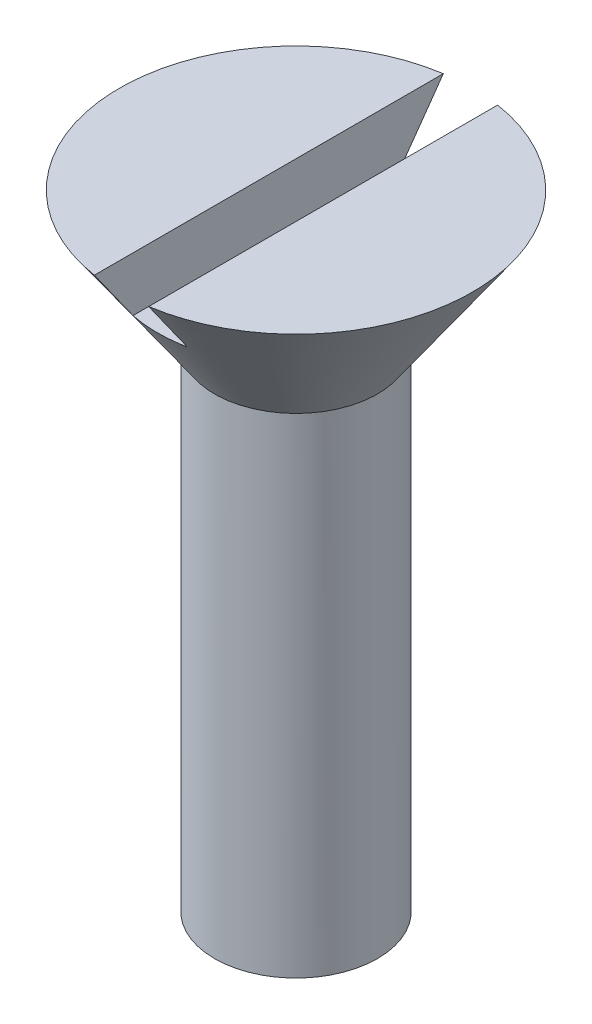
ISO-10303-21;
HEADER;
FILE_DESCRIPTION(('STEP AP214'),'2;1');
FILE_NAME('part.step','',(''),(''),'','','');
FILE_SCHEMA(('AUTOMOTIVE_DESIGN { 1 0 10303 214 1 1 1 1 }'));
ENDSEC;
DATA;
#1=APPLICATION_CONTEXT('core data for automotive mechanical design processes');
#2=APPLICATION_PROTOCOL_DEFINITION('international standard','automotive_design',2000,#1);
#3=PRODUCT_CONTEXT('',#1,'mechanical');
#4=PRODUCT('Part','Part','',(#3));
#5=PRODUCT_RELATED_PRODUCT_CATEGORY('part','',(#4));
#6=PRODUCT_DEFINITION_FORMATION('','',#4);
#7=PRODUCT_DEFINITION_CONTEXT('part definition',#1,'design');
#8=PRODUCT_DEFINITION('design','',#6,#7);
#9=PRODUCT_DEFINITION_SHAPE('','',#8);
#10=(LENGTH_UNIT() NAMED_UNIT(*) SI_UNIT(.MILLI.,.METRE.));
#11=(NAMED_UNIT(*) PLANE_ANGLE_UNIT() SI_UNIT($,.RADIAN.));
#12=(NAMED_UNIT(*) SI_UNIT($,.STERADIAN.) SOLID_ANGLE_UNIT());
#13=UNCERTAINTY_MEASURE_WITH_UNIT(LENGTH_MEASURE(1.E-05),#10,'distance_accuracy_value','');
#14=(GEOMETRIC_REPRESENTATION_CONTEXT(3) GLOBAL_UNCERTAINTY_ASSIGNED_CONTEXT((#13)) GLOBAL_UNIT_ASSIGNED_CONTEXT((#10,
#11,#12)) REPRESENTATION_CONTEXT('',''));
#15=CARTESIAN_POINT('',(0.,0.,0.));
#16=DIRECTION('',(0.,0.,1.));
#17=DIRECTION('',(1.,0.,0.));
#18=AXIS2_PLACEMENT_3D('',#15,#16,#17);
#19=CARTESIAN_POINT('',(6.5,24.7320508075689,0.));
#20=DIRECTION('',(0.,1.,0.));
#21=DIRECTION('',(0.,0.,1.));
#22=AXIS2_PLACEMENT_3D('',#19,#20,#21);
#23=PLANE('',#22);
#24=DIRECTION('',(0.,0.,1.));
#25=VECTOR('',#24,1.);
#26=CARTESIAN_POINT('',(-1.,24.7320508075689,0.));
#27=LINE('',#26,#25);
#28=CARTESIAN_POINT('',(-1.,24.7320508075689,-6.42261628933256));
#29=VERTEX_POINT('',#28);
#30=CARTESIAN_POINT('',(-1.,24.7320508075689,6.42261628933256));
#31=VERTEX_POINT('',#30);
#32=EDGE_CURVE('E100',#29,#31,#27,.T.);
#33=ORIENTED_EDGE('',*,*,#32,.F.);
#34=CARTESIAN_POINT('',(0.,24.7320508075689,0.));
#35=DIRECTION('',(0.,-1.,0.));
#36=DIRECTION('',(0.,0.,-1.));
#37=AXIS2_PLACEMENT_3D('',#34,#35,#36);
#38=CIRCLE('',#37,6.5);
#39=EDGE_CURVE('E112',#31,#29,#38,.T.);
#40=ORIENTED_EDGE('',*,*,#39,.F.);
#41=EDGE_LOOP('',(#33,#40));
#42=FACE_BOUND('',#41,.T.);
#43=ADVANCED_FACE('F38',(#42),#23,.T.);
#44=CARTESIAN_POINT('',(0.,0.,0.));
#45=DIRECTION('',(0.,1.,0.));
#46=DIRECTION('',(0.,0.,1.));
#47=AXIS2_PLACEMENT_3D('',#44,#45,#46);
#48=CONICAL_SURFACE('',#47,0.,1.0471975511966);
#49=CARTESIAN_POINT('',(0.,1.73205080756887,0.));
#50=DIRECTION('',(0.,-1.,0.));
#51=DIRECTION('',(0.,0.,-1.));
#52=AXIS2_PLACEMENT_3D('',#49,#50,#51);
#53=CIRCLE('',#52,3.);
#54=CARTESIAN_POINT('',(0.,1.73205080756887,-3.));
#55=VERTEX_POINT('',#54);
#56=EDGE_CURVE('E103',#55,#55,#53,.T.);
#57=ORIENTED_EDGE('',*,*,#56,.T.);
#58=EDGE_LOOP('',(#57));
#59=FACE_BOUND('',#58,.T.);
#60=CARTESIAN_POINT('',(0.,0.,0.));
#61=VERTEX_POINT('',#60);
#62=VERTEX_LOOP('',#61);
#63=FACE_BOUND('',#62,.T.);
#64=ADVANCED_FACE('F40',(#59,#63),#48,.T.);
#65=CARTESIAN_POINT('',(0.,-8.0008177119333,0.));
#66=DIRECTION('',(0.,-1.,0.));
#67=DIRECTION('',(0.,0.,-1.));
#68=AXIS2_PLACEMENT_3D('',#65,#66,#67);
#69=CYLINDRICAL_SURFACE('',#68,3.);
#70=CARTESIAN_POINT('',(0.,19.7320508075689,0.));
#71=DIRECTION('',(0.,-1.,0.));
#72=DIRECTION('',(0.,0.,-1.));
#73=AXIS2_PLACEMENT_3D('',#70,#71,#72);
#74=CIRCLE('',#73,3.);
#75=CARTESIAN_POINT('',(0.,19.7320508075689,-3.));
#76=VERTEX_POINT('',#75);
#77=EDGE_CURVE('E108',#76,#76,#74,.T.);
#78=ORIENTED_EDGE('',*,*,#77,.T.);
#79=EDGE_LOOP('',(#78));
#80=FACE_BOUND('',#79,.T.);
#81=ORIENTED_EDGE('',*,*,#56,.F.);
#82=EDGE_LOOP('',(#81));
#83=FACE_BOUND('',#82,.T.);
#84=ADVANCED_FACE('F139',(#80,#83),#69,.T.);
#85=CARTESIAN_POINT('',(0.,19.7320508075689,0.));
#86=DIRECTION('',(0.,1.,0.));
#87=DIRECTION('',(0.,0.,1.));
#88=AXIS2_PLACEMENT_3D('',#85,#86,#87);
#89=CONICAL_SURFACE('',#88,3.,0.610725964389209);
#90=CARTESIAN_POINT('',(-1.,24.7327508075689,6.4231121927069));
#91=CARTESIAN_POINT('',(-1.,24.4816478343582,6.24521507547194));
#92=CARTESIAN_POINT('',(-1.,24.230620458814,6.06721105785794));
#93=CARTESIAN_POINT('',(-1.,23.7287653728335,5.71088793330972));
#94=CARTESIAN_POINT('',(-1.,23.477937676158,5.53256880699694));
#95=CARTESIAN_POINT('',(-1.,22.9758036344212,5.17499647886703));
#96=CARTESIAN_POINT('',(-1.,22.7244981387982,4.99574208349889));
#97=CARTESIAN_POINT('',(-1.,22.2222921616879,4.63669913452876));
#98=CARTESIAN_POINT('',(-0.999999999999999,21.9713916564717,4.45691061411517));
#99=CARTESIAN_POINT('',(-0.999999999999999,21.4113851281488,4.05434246098988));
#100=CARTESIAN_POINT('',(-0.999999999999999,21.1024215497345,3.83136424535592));
#101=CARTESIAN_POINT('',(-0.999999999999999,20.6399833306106,3.49544297230533));
#102=CARTESIAN_POINT('',(-0.999999999999999,20.4859892965073,3.38321524822287));
#103=CARTESIAN_POINT('',(-0.999999999999999,20.1784731953449,3.15811915839284));
#104=CARTESIAN_POINT('',(-0.999999999999999,20.0249511215442,3.04525080186237));
#105=CARTESIAN_POINT('',(-0.999999999999999,19.718949442271,2.81893473483323));
#106=CARTESIAN_POINT('',(-0.999999999999999,19.5664681653534,2.70548928810727));
#107=CARTESIAN_POINT('',(-0.999999999999999,19.2624202540632,2.47735955209802));
#108=CARTESIAN_POINT('',(-0.999999999999999,19.1108536738174,2.36267519060135));
#109=CARTESIAN_POINT('',(-0.999999999999999,18.809159033189,2.13153400820381));
#110=CARTESIAN_POINT('',(-0.999999999999999,18.6590304598624,2.01507786083154));
#111=CARTESIAN_POINT('',(-0.999999999999999,18.4355564824097,1.83823431248961));
#112=CARTESIAN_POINT('',(-0.999999999999999,18.3613552017325,1.77892951008025));
#113=CARTESIAN_POINT('',(-0.999999999999999,18.2137184400952,1.65937552484643));
#114=CARTESIAN_POINT('',(-0.999999999999999,18.1402829356587,1.59912637111531));
#115=CARTESIAN_POINT('',(-0.999999999999999,18.0183910739441,1.49735496061013));
#116=CARTESIAN_POINT('',(-0.999999999999999,17.9696474909647,1.45617701216027));
#117=CARTESIAN_POINT('',(-0.999999999999999,17.8727548774056,1.37311830533831));
#118=CARTESIAN_POINT('',(-0.999999999999999,17.8246058929168,1.33123749306917));
#119=CARTESIAN_POINT('',(-0.999999999999999,17.7289030340928,1.24644783826052));
#120=CARTESIAN_POINT('',(-0.999999999999999,17.6813519992002,1.20353578171963));
#121=CARTESIAN_POINT('',(-0.999999999999999,17.5872849160699,1.11660199553977));
#122=CARTESIAN_POINT('',(-0.999999999999999,17.5407687000913,1.07258044824988));
#123=CARTESIAN_POINT('',(-0.999999999999999,17.4503329622812,0.984258875571616));
#124=CARTESIAN_POINT('',(-0.999999999999999,17.4063773625437,0.939995978319388));
#125=CARTESIAN_POINT('',(-0.999999999999999,17.3203433250885,0.849685965186151));
#126=CARTESIAN_POINT('',(-0.999999999999999,17.2782643855641,0.803639332492838));
#127=CARTESIAN_POINT('',(-0.999999999999999,17.1970522277732,0.709408627074623));
#128=CARTESIAN_POINT('',(-0.999999999999999,17.157905031252,0.66123670433491));
#129=CARTESIAN_POINT('',(-0.999999999999999,17.0837947987634,0.561804744039555));
#130=CARTESIAN_POINT('',(-0.999999999999999,17.0488242705169,0.510550491890749));
#131=CARTESIAN_POINT('',(-0.999999999999999,17.0044323851084,0.435811432213111));
#132=CARTESIAN_POINT('',(-0.999999999999999,16.9922117729092,0.413994672182494));
#133=CARTESIAN_POINT('',(-0.999999999999999,16.96910325899,0.369660988832996));
#134=CARTESIAN_POINT('',(-0.999999999999999,16.9582158295957,0.347143820893278));
#135=CARTESIAN_POINT('',(-0.999999999999999,16.9280475173432,0.278664441259216));
#136=CARTESIAN_POINT('',(-0.999999999999999,16.911142164786,0.231583649581735));
#137=CARTESIAN_POINT('',(-0.999999999999999,16.8885249993827,0.143751659910728));
#138=CARTESIAN_POINT('',(-0.999999999999999,16.8813458036271,0.103387133416546));
#139=CARTESIAN_POINT('',(-0.999999999999999,16.8740759410857,0.0219594036923862));
#140=CARTESIAN_POINT('',(-0.999999999999999,16.87399032981,-0.0191042769698395));
#141=CARTESIAN_POINT('',(-0.999999999999999,16.8809302935727,-0.100503321516519));
#142=CARTESIAN_POINT('',(-0.999999999999999,16.8879401011999,-0.140840098426747));
#143=CARTESIAN_POINT('',(-0.999999999999999,16.9079886678123,-0.219934025983459));
#144=CARTESIAN_POINT('',(-0.999999999999999,16.9210285051829,-0.258690892735774));
#145=CARTESIAN_POINT('',(-0.999999999999999,16.9501704775401,-0.330465253321082));
#146=CARTESIAN_POINT('',(-0.999999999999999,16.9658316207442,-0.363667547268316));
#147=CARTESIAN_POINT('',(-0.999999999999999,16.9999907490362,-0.42859561901245));
#148=CARTESIAN_POINT('',(-0.999999999999999,17.0184912974861,-0.460320028527866));
#149=CARTESIAN_POINT('',(-0.999999999999999,17.0577185210066,-0.522585950662284));
#150=CARTESIAN_POINT('',(-0.999999999999999,17.0784567842935,-0.553120070167363));
#151=CARTESIAN_POINT('',(-0.999999999999999,17.121545165438,-0.612996566707749));
#152=CARTESIAN_POINT('',(-0.999999999999999,17.1438945464504,-0.642339479063711));
#153=CARTESIAN_POINT('',(-0.999999999999999,17.2142159517829,-0.730686952033592));
#154=CARTESIAN_POINT('',(-0.999999999999999,17.2641890895365,-0.788092695306636));
#155=CARTESIAN_POINT('',(-0.999999999999999,17.3673147382465,-0.899994752825899));
#156=CARTESIAN_POINT('',(-0.999999999999999,17.4204700671478,-0.954488405025309));
#157=CARTESIAN_POINT('',(-0.999999999999999,17.5289889955385,-1.06149306115467));
#158=CARTESIAN_POINT('',(-0.999999999999999,17.5843577273465,-1.11399883295358));
#159=CARTESIAN_POINT('',(-0.999999999999999,17.6965338372843,-1.21745270602294));
#160=CARTESIAN_POINT('',(-0.999999999999999,17.7533413904433,-1.26840061610314));
#161=CARTESIAN_POINT('',(-0.999999999999999,17.868419646872,-1.36949512242314));
#162=CARTESIAN_POINT('',(-0.999999999999999,17.9266981340377,-1.4196328283806));
#163=CARTESIAN_POINT('',(-0.999999999999999,18.0440392779179,-1.51898955075171));
#164=CARTESIAN_POINT('',(-0.999999999999999,18.1031020013697,-1.56820848811066));
#165=CARTESIAN_POINT('',(-0.999999999999999,18.2217193901382,-1.66583472159213));
#166=CARTESIAN_POINT('',(-0.999999999999999,18.2812730087172,-1.71424329188758));
#167=CARTESIAN_POINT('',(-0.999999999999999,18.4008448762615,-1.81047784179121));
#168=CARTESIAN_POINT('',(-0.999999999999999,18.4608631087176,-1.85830384194613));
#169=CARTESIAN_POINT('',(-0.999999999999999,18.6504726478406,-2.00819700899554));
#170=CARTESIAN_POINT('',(-0.999999999999999,18.780732062956,-2.10941865781121));
#171=CARTESIAN_POINT('',(-0.999999999999999,19.0423560770634,-2.31042525016907));
#172=CARTESIAN_POINT('',(-0.999999999999999,19.1737207107572,-2.41021014833129));
#173=CARTESIAN_POINT('',(-0.999999999999999,19.4372289909591,-2.60877175431691));
#174=CARTESIAN_POINT('',(-0.999999999999999,19.5693727119732,-2.70754836316459));
#175=CARTESIAN_POINT('',(-0.999999999999999,19.8342144382065,-2.9043562043297));
#176=CARTESIAN_POINT('',(-0.999999999999999,19.9669124466861,-3.00238743225336));
#177=CARTESIAN_POINT('',(-0.999999999999999,20.3659111351029,-3.29586613365333));
#178=CARTESIAN_POINT('',(-0.999999999999999,20.6328245366697,-3.49048011542738));
#179=CARTESIAN_POINT('',(-0.999999999999999,21.167604500372,-3.8783582601765));
#180=CARTESIAN_POINT('',(-0.999999999999999,21.4354710073649,-4.07162249938512));
#181=CARTESIAN_POINT('',(-0.999999999999999,21.9555026521788,-4.44551854449072));
#182=CARTESIAN_POINT('',(-1.,22.2076301932421,-4.62620266343094));
#183=CARTESIAN_POINT('',(-1.,22.7122837485915,-4.98702305613861));
#184=CARTESIAN_POINT('',(-1.,22.9648097701302,-5.1671593197558));
#185=CARTESIAN_POINT('',(-1.,23.4697857756402,-5.52677185493383));
#186=CARTESIAN_POINT('',(-1.,23.7222353495944,-5.70624870244838));
#187=CARTESIAN_POINT('',(-1.,24.2273481466322,-6.06489037383144));
#188=CARTESIAN_POINT('',(-1.,24.4800113651498,-6.24405520412977));
#189=CARTESIAN_POINT('',(-1.,24.7327508075689,-6.42311219270689));
#190=B_SPLINE_CURVE_WITH_KNOTS('',3,(#90,#91,#92,#93,#94,#95,#96,#97,#98,#99,#100,#101,#102,
#103,#104,#105,#106,#107,#108,#109,#110,#111,#112,#113,#114,#115,#116,#117,#118,#119,#120,#121,
#122,#123,#124,#125,#126,#127,#128,#129,#130,#131,#132,#133,#134,#135,#136,#137,#138,#139,#140,
#141,#142,#143,#144,#145,#146,#147,#148,#149,#150,#151,#152,#153,#154,#155,#156,#157,#158,#159,
#160,#161,#162,#163,#164,#165,#166,#167,#168,#169,#170,#171,#172,#173,#174,#175,#176,#177,#178,
#179,#180,#181,#182,#183,#184,#185,#186,#187,#188,#189),.UNSPECIFIED.,.F.,.F.,(4,2,2,2,2,2,2,2,
2,2,2,2,2,2,2,2,2,2,2,2,2,2,2,2,2,2,2,2,2,2,2,2,2,2,2,2,2,2,2,2,2,2,2,2,2,2,2,2,2,4),(0.,
0.923201509240981,1.84646192008954,2.77251707641881,3.69851584706984,4.84157654201848,
5.41322473304252,5.98486472022836,6.55502115896761,7.12521101202563,7.69518927526239,
7.98015070767564,8.26510337825439,8.45652467666824,8.64796072134151,8.84010072326167,
9.03220934955081,9.2193134976021,9.40636731153534,9.59246346676997,9.77822061490546,
9.85319794763915,9.92820176727316,10.0775406581727,10.1999903842997,10.3225273780829,
10.4447926671675,10.5670798301291,10.6770443346272,10.7871087034044,10.8977732132442,
11.0083874278571,11.2364917496226,11.4648011428321,11.6936747166945,11.9225762674853,
12.1531967152283,12.3838369158941,12.6140718598638,12.8442986600009,13.3391746463811,
13.8340662293546,14.3290059335491,14.8239485529878,15.8149277270123,16.8058504703305,
17.7364058749223,18.6669784163907,19.5962168450814,20.5254358925289),.UNSPECIFIED.);
#191=CARTESIAN_POINT('',(-0.999999999999999,22.7320508075689,5.00099990001999));
#192=VERTEX_POINT('',#191);
#193=EDGE_CURVE('E114',#31,#192,#190,.T.);
#194=ORIENTED_EDGE('',*,*,#193,.F.);
#195=ORIENTED_EDGE('',*,*,#39,.T.);
#196=CARTESIAN_POINT('',(-0.999999999999999,22.7320508075689,-5.00099990001999));
#197=VERTEX_POINT('',#196);
#198=EDGE_CURVE('E86',#197,#29,#190,.T.);
#199=ORIENTED_EDGE('',*,*,#198,.F.);
#200=CARTESIAN_POINT('',(0.,22.7320508075689,0.));
#201=DIRECTION('',(0.,-1.,0.));
#202=DIRECTION('',(0.,0.,-1.));
#203=AXIS2_PLACEMENT_3D('',#200,#201,#202);
#204=CIRCLE('',#203,5.1);
#205=CARTESIAN_POINT('',(0.999999999999999,22.7320508075689,-5.00099990001999));
#206=VERTEX_POINT('',#205);
#207=EDGE_CURVE('E42',#206,#197,#204,.F.);
#208=ORIENTED_EDGE('',*,*,#207,.F.);
#209=CARTESIAN_POINT('',(1.,24.7327508075689,-6.4231121927069));
#210=CARTESIAN_POINT('',(1.,24.4816478343582,-6.24521507547194));
#211=CARTESIAN_POINT('',(1.,24.230620458814,-6.06721105785794));
#212=CARTESIAN_POINT('',(1.,23.7287653728335,-5.71088793330972));
#213=CARTESIAN_POINT('',(1.,23.477937676158,-5.53256880699694));
#214=CARTESIAN_POINT('',(1.,22.9758036344212,-5.17499647886703));
#215=CARTESIAN_POINT('',(1.,22.7244981387982,-4.99574208349889));
#216=CARTESIAN_POINT('',(1.,22.2222921616879,-4.63669913452876));
#217=CARTESIAN_POINT('',(0.999999999999999,21.9713916564717,-4.45691061411517));
#218=CARTESIAN_POINT('',(0.999999999999999,21.4113851281488,-4.05434246098988));
#219=CARTESIAN_POINT('',(0.999999999999999,21.1024215497345,-3.83136424535592));
#220=CARTESIAN_POINT('',(0.999999999999999,20.6399833306106,-3.49544297230533));
#221=CARTESIAN_POINT('',(0.999999999999999,20.4859892965073,-3.38321524822287));
#222=CARTESIAN_POINT('',(0.999999999999999,20.1784731953449,-3.15811915839284));
#223=CARTESIAN_POINT('',(0.999999999999999,20.0249511215442,-3.04525080186237));
#224=CARTESIAN_POINT('',(0.999999999999999,19.718949442271,-2.81893473483323));
#225=CARTESIAN_POINT('',(0.999999999999999,19.5664681653534,-2.70548928810727));
#226=CARTESIAN_POINT('',(0.999999999999999,19.2624202540632,-2.47735955209802));
#227=CARTESIAN_POINT('',(0.999999999999999,19.1108536738174,-2.36267519060135));
#228=CARTESIAN_POINT('',(0.999999999999999,18.809159033189,-2.13153400820381));
#229=CARTESIAN_POINT('',(0.999999999999999,18.6590304598624,-2.01507786083154));
#230=CARTESIAN_POINT('',(0.999999999999999,18.4355564824097,-1.83823431248961));
#231=CARTESIAN_POINT('',(0.999999999999999,18.3613552017325,-1.77892951008025));
#232=CARTESIAN_POINT('',(0.999999999999999,18.2137184400952,-1.65937552484643));
#233=CARTESIAN_POINT('',(0.999999999999999,18.1402829356587,-1.59912637111531));
#234=CARTESIAN_POINT('',(0.999999999999999,18.0183910739441,-1.49735496061013));
#235=CARTESIAN_POINT('',(0.999999999999999,17.9696474909647,-1.45617701216027));
#236=CARTESIAN_POINT('',(0.999999999999999,17.8727548774056,-1.37311830533831));
#237=CARTESIAN_POINT('',(0.999999999999999,17.8246058929168,-1.33123749306917));
#238=CARTESIAN_POINT('',(0.999999999999999,17.7289030340928,-1.24644783826052));
#239=CARTESIAN_POINT('',(0.999999999999999,17.6813519992002,-1.20353578171963));
#240=CARTESIAN_POINT('',(0.999999999999999,17.5872849160699,-1.11660199553977));
#241=CARTESIAN_POINT('',(0.999999999999999,17.5407687000913,-1.07258044824988));
#242=CARTESIAN_POINT('',(0.999999999999999,17.4503329622812,-0.984258875571616));
#243=CARTESIAN_POINT('',(0.999999999999999,17.4063773625437,-0.939995978319388));
#244=CARTESIAN_POINT('',(0.999999999999999,17.3203433250885,-0.849685965186151));
#245=CARTESIAN_POINT('',(0.999999999999999,17.2782643855641,-0.803639332492838));
#246=CARTESIAN_POINT('',(0.999999999999999,17.1970522277732,-0.709408627074623));
#247=CARTESIAN_POINT('',(0.999999999999999,17.157905031252,-0.66123670433491));
#248=CARTESIAN_POINT('',(0.999999999999999,17.0837947987634,-0.561804744039555));
#249=CARTESIAN_POINT('',(0.999999999999999,17.0488242705169,-0.510550491890749));
#250=CARTESIAN_POINT('',(0.999999999999999,17.0044323851084,-0.435811432213111));
#251=CARTESIAN_POINT('',(0.999999999999999,16.9922117729092,-0.413994672182494));
#252=CARTESIAN_POINT('',(0.999999999999999,16.96910325899,-0.369660988832996));
#253=CARTESIAN_POINT('',(0.999999999999999,16.9582158295957,-0.347143820893278));
#254=CARTESIAN_POINT('',(0.999999999999999,16.9280475173432,-0.278664441259216));
#255=CARTESIAN_POINT('',(0.999999999999999,16.911142164786,-0.231583649581735));
#256=CARTESIAN_POINT('',(0.999999999999999,16.8885249993827,-0.143751659910728));
#257=CARTESIAN_POINT('',(0.999999999999999,16.8813458036271,-0.103387133416546));
#258=CARTESIAN_POINT('',(0.999999999999999,16.8740759410857,-0.0219594036923862));
#259=CARTESIAN_POINT('',(0.999999999999999,16.87399032981,0.0191042769698395));
#260=CARTESIAN_POINT('',(0.999999999999999,16.8809302935727,0.100503321516519));
#261=CARTESIAN_POINT('',(0.999999999999999,16.8879401011999,0.140840098426747));
#262=CARTESIAN_POINT('',(0.999999999999999,16.9079886678123,0.219934025983459));
#263=CARTESIAN_POINT('',(0.999999999999999,16.9210285051829,0.258690892735774));
#264=CARTESIAN_POINT('',(0.999999999999999,16.9501704775401,0.330465253321082));
#265=CARTESIAN_POINT('',(0.999999999999999,16.9658316207442,0.363667547268316));
#266=CARTESIAN_POINT('',(0.999999999999999,16.9999907490362,0.42859561901245));
#267=CARTESIAN_POINT('',(0.999999999999999,17.0184912974861,0.460320028527866));
#268=CARTESIAN_POINT('',(0.999999999999999,17.0577185210066,0.522585950662284));
#269=CARTESIAN_POINT('',(0.999999999999999,17.0784567842935,0.553120070167363));
#270=CARTESIAN_POINT('',(0.999999999999999,17.121545165438,0.612996566707749));
#271=CARTESIAN_POINT('',(0.999999999999999,17.1438945464504,0.642339479063711));
#272=CARTESIAN_POINT('',(0.999999999999999,17.2142159517829,0.730686952033592));
#273=CARTESIAN_POINT('',(0.999999999999999,17.2641890895365,0.788092695306636));
#274=CARTESIAN_POINT('',(0.999999999999999,17.3673147382465,0.899994752825899));
#275=CARTESIAN_POINT('',(0.999999999999999,17.4204700671478,0.954488405025309));
#276=CARTESIAN_POINT('',(0.999999999999999,17.5289889955385,1.06149306115467));
#277=CARTESIAN_POINT('',(0.999999999999999,17.5843577273465,1.11399883295358));
#278=CARTESIAN_POINT('',(0.999999999999999,17.6965338372843,1.21745270602294));
#279=CARTESIAN_POINT('',(0.999999999999999,17.7533413904433,1.26840061610314));
#280=CARTESIAN_POINT('',(0.999999999999999,17.868419646872,1.36949512242314));
#281=CARTESIAN_POINT('',(0.999999999999999,17.9266981340377,1.4196328283806));
#282=CARTESIAN_POINT('',(0.999999999999999,18.0440392779179,1.51898955075171));
#283=CARTESIAN_POINT('',(0.999999999999999,18.1031020013697,1.56820848811066));
#284=CARTESIAN_POINT('',(0.999999999999999,18.2217193901382,1.66583472159213));
#285=CARTESIAN_POINT('',(0.999999999999999,18.2812730087172,1.71424329188758));
#286=CARTESIAN_POINT('',(0.999999999999999,18.4008448762615,1.81047784179121));
#287=CARTESIAN_POINT('',(0.999999999999999,18.4608631087176,1.85830384194613));
#288=CARTESIAN_POINT('',(0.999999999999999,18.6504726478406,2.00819700899554));
#289=CARTESIAN_POINT('',(0.999999999999999,18.780732062956,2.10941865781121));
#290=CARTESIAN_POINT('',(0.999999999999999,19.0423560770634,2.31042525016907));
#291=CARTESIAN_POINT('',(0.999999999999999,19.1737207107572,2.41021014833129));
#292=CARTESIAN_POINT('',(0.999999999999999,19.4372289909591,2.60877175431691));
#293=CARTESIAN_POINT('',(0.999999999999999,19.5693727119732,2.70754836316459));
#294=CARTESIAN_POINT('',(0.999999999999999,19.8342144382065,2.9043562043297));
#295=CARTESIAN_POINT('',(0.999999999999999,19.9669124466861,3.00238743225336));
#296=CARTESIAN_POINT('',(0.999999999999999,20.3659111351029,3.29586613365333));
#297=CARTESIAN_POINT('',(0.999999999999999,20.6328245366697,3.49048011542738));
#298=CARTESIAN_POINT('',(0.999999999999999,21.167604500372,3.8783582601765));
#299=CARTESIAN_POINT('',(0.999999999999999,21.4354710073649,4.07162249938512));
#300=CARTESIAN_POINT('',(0.999999999999999,21.9555026521788,4.44551854449072));
#301=CARTESIAN_POINT('',(1.,22.2076301932421,4.62620266343094));
#302=CARTESIAN_POINT('',(1.,22.7122837485915,4.98702305613861));
#303=CARTESIAN_POINT('',(1.,22.9648097701302,5.1671593197558));
#304=CARTESIAN_POINT('',(1.,23.4697857756402,5.52677185493383));
#305=CARTESIAN_POINT('',(1.,23.7222353495944,5.70624870244838));
#306=CARTESIAN_POINT('',(1.,24.2273481466322,6.06489037383144));
#307=CARTESIAN_POINT('',(1.,24.4800113651498,6.24405520412977));
#308=CARTESIAN_POINT('',(1.,24.7327508075689,6.42311219270689));
#309=B_SPLINE_CURVE_WITH_KNOTS('',3,(#209,#210,#211,#212,#213,#214,#215,#216,#217,#218,#219,
#220,#221,#222,#223,#224,#225,#226,#227,#228,#229,#230,#231,#232,#233,#234,#235,#236,#237,#238,
#239,#240,#241,#242,#243,#244,#245,#246,#247,#248,#249,#250,#251,#252,#253,#254,#255,#256,#257,
#258,#259,#260,#261,#262,#263,#264,#265,#266,#267,#268,#269,#270,#271,#272,#273,#274,#275,#276,
#277,#278,#279,#280,#281,#282,#283,#284,#285,#286,#287,#288,#289,#290,#291,#292,#293,#294,#295,
#296,#297,#298,#299,#300,#301,#302,#303,#304,#305,#306,#307,#308),.UNSPECIFIED.,.F.,.F.,(4,2,2,
2,2,2,2,2,2,2,2,2,2,2,2,2,2,2,2,2,2,2,2,2,2,2,2,2,2,2,2,2,2,2,2,2,2,2,2,2,2,2,2,2,2,2,2,2,2,4),
(0.,0.923201509240981,1.84646192008954,2.77251707641881,3.69851584706984,4.84157654201848,
5.41322473304252,5.98486472022836,6.55502115896761,7.12521101202563,7.69518927526239,
7.98015070767564,8.26510337825439,8.45652467666824,8.64796072134151,8.84010072326167,
9.03220934955081,9.2193134976021,9.40636731153534,9.59246346676997,9.77822061490546,
9.85319794763915,9.92820176727316,10.0775406581727,10.1999903842997,10.3225273780829,
10.4447926671675,10.5670798301291,10.6770443346272,10.7871087034044,10.8977732132442,
11.0083874278571,11.2364917496226,11.4648011428321,11.6936747166945,11.9225762674853,
12.1531967152283,12.3838369158941,12.6140718598638,12.8442986600009,13.3391746463811,
13.8340662293546,14.3290059335491,14.8239485529878,15.8149277270123,16.8058504703305,
17.7364058749223,18.6669784163907,19.5962168450814,20.5254358925289),.UNSPECIFIED.);
#310=CARTESIAN_POINT('',(1.,24.7320508075689,-6.42261628933256));
#311=VERTEX_POINT('',#310);
#312=EDGE_CURVE('E77',#311,#206,#309,.T.);
#313=ORIENTED_EDGE('',*,*,#312,.F.);
#314=CARTESIAN_POINT('',(1.,24.7320508075689,6.42261628933256));
#315=VERTEX_POINT('',#314);
#316=EDGE_CURVE('E111',#311,#315,#38,.T.);
#317=ORIENTED_EDGE('',*,*,#316,.T.);
#318=CARTESIAN_POINT('',(0.999999999999999,22.7320508075689,5.00099990001999));
#319=VERTEX_POINT('',#318);
#320=EDGE_CURVE('E53',#319,#315,#309,.T.);
#321=ORIENTED_EDGE('',*,*,#320,.F.);
#322=EDGE_CURVE('E12',#192,#319,#204,.F.);
#323=ORIENTED_EDGE('',*,*,#322,.F.);
#324=EDGE_LOOP('',(#194,#195,#199,#208,#313,#317,#321,#323));
#325=FACE_BOUND('',#324,.T.);
#326=ORIENTED_EDGE('',*,*,#77,.F.);
#327=EDGE_LOOP('',(#326));
#328=FACE_BOUND('',#327,.T.);
#329=ADVANCED_FACE('F97',(#325,#328),#89,.T.);
#330=DIRECTION('',(0.,0.,-1.));
#331=VECTOR('',#330,1.);
#332=CARTESIAN_POINT('',(1.,24.7320508075689,0.));
#333=LINE('',#332,#331);
#334=EDGE_CURVE('E81',#315,#311,#333,.T.);
#335=ORIENTED_EDGE('',*,*,#334,.F.);
#336=ORIENTED_EDGE('',*,*,#316,.F.);
#337=EDGE_LOOP('',(#335,#336));
#338=FACE_BOUND('',#337,.T.);
#339=ADVANCED_FACE('F133',(#338),#23,.T.);
#340=CARTESIAN_POINT('',(-1.,25.7320508075689,-6.5));
#341=DIRECTION('',(-1.,0.,0.));
#342=DIRECTION('',(0.,-1.,0.));
#343=AXIS2_PLACEMENT_3D('',#340,#341,#342);
#344=PLANE('',#343);
#345=ORIENTED_EDGE('',*,*,#193,.T.);
#346=DIRECTION('',(0.,0.,1.));
#347=VECTOR('',#346,1.);
#348=CARTESIAN_POINT('',(-1.,22.7320508075689,-6.5));
#349=LINE('',#348,#347);
#350=EDGE_CURVE('E93',#197,#192,#349,.T.);
#351=ORIENTED_EDGE('',*,*,#350,.F.);
#352=ORIENTED_EDGE('',*,*,#198,.T.);
#353=ORIENTED_EDGE('',*,*,#32,.T.);
#354=EDGE_LOOP('',(#345,#351,#352,#353));
#355=FACE_BOUND('',#354,.T.);
#356=ADVANCED_FACE('F129',(#355),#344,.F.);
#357=CARTESIAN_POINT('',(1.,25.7320508075689,-6.5));
#358=DIRECTION('',(1.,0.,0.));
#359=DIRECTION('',(0.,1.,0.));
#360=AXIS2_PLACEMENT_3D('',#357,#358,#359);
#361=PLANE('',#360);
#362=ORIENTED_EDGE('',*,*,#312,.T.);
#363=DIRECTION('',(0.,0.,1.));
#364=VECTOR('',#363,1.);
#365=CARTESIAN_POINT('',(1.,22.7320508075689,-6.5));
#366=LINE('',#365,#364);
#367=EDGE_CURVE('E80',#206,#319,#366,.T.);
#368=ORIENTED_EDGE('',*,*,#367,.T.);
#369=ORIENTED_EDGE('',*,*,#320,.T.);
#370=ORIENTED_EDGE('',*,*,#334,.T.);
#371=EDGE_LOOP('',(#362,#368,#369,#370));
#372=FACE_BOUND('',#371,.T.);
#373=ADVANCED_FACE('F79',(#372),#361,.F.);
#374=CARTESIAN_POINT('',(-1.,22.7320508075689,-6.5));
#375=DIRECTION('',(0.,-1.,0.));
#376=DIRECTION('',(0.,0.,-1.));
#377=AXIS2_PLACEMENT_3D('',#374,#375,#376);
#378=PLANE('',#377);
#379=ORIENTED_EDGE('',*,*,#322,.T.);
#380=ORIENTED_EDGE('',*,*,#367,.F.);
#381=ORIENTED_EDGE('',*,*,#207,.T.);
#382=ORIENTED_EDGE('',*,*,#350,.T.);
#383=EDGE_LOOP('',(#379,#380,#381,#382));
#384=FACE_BOUND('',#383,.T.);
#385=ADVANCED_FACE('F89',(#384),#378,.F.);
#386=CLOSED_SHELL('',(#43,#64,#84,#329,#339,#356,#373,#385));
#387=MANIFOLD_SOLID_BREP('B2',#386);
#388=ADVANCED_BREP_SHAPE_REPRESENTATION('',(#18,#387),#14);
#389=SHAPE_DEFINITION_REPRESENTATION(#9,#388);
ENDSEC;
END-ISO-10303-21;
